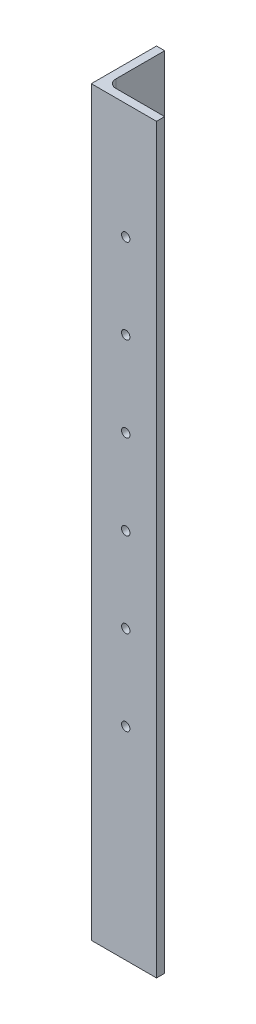
ISO-10303-21;
HEADER;
FILE_DESCRIPTION(('STEP AP214'),'2;1');
FILE_NAME('part.step','',(''),(''),'','','');
FILE_SCHEMA(('AUTOMOTIVE_DESIGN { 1 0 10303 214 1 1 1 1 }'));
ENDSEC;
DATA;
#1=APPLICATION_CONTEXT('core data for automotive mechanical design processes');
#2=APPLICATION_PROTOCOL_DEFINITION('international standard','automotive_design',2000,#1);
#3=PRODUCT_CONTEXT('',#1,'mechanical');
#4=PRODUCT('Part','Part','',(#3));
#5=PRODUCT_RELATED_PRODUCT_CATEGORY('part','',(#4));
#6=PRODUCT_DEFINITION_FORMATION('','',#4);
#7=PRODUCT_DEFINITION_CONTEXT('part definition',#1,'design');
#8=PRODUCT_DEFINITION('design','',#6,#7);
#9=PRODUCT_DEFINITION_SHAPE('','',#8);
#10=(LENGTH_UNIT() NAMED_UNIT(*) SI_UNIT(.MILLI.,.METRE.));
#11=(NAMED_UNIT(*) PLANE_ANGLE_UNIT() SI_UNIT($,.RADIAN.));
#12=(NAMED_UNIT(*) SI_UNIT($,.STERADIAN.) SOLID_ANGLE_UNIT());
#13=UNCERTAINTY_MEASURE_WITH_UNIT(LENGTH_MEASURE(1.E-05),#10,'distance_accuracy_value','');
#14=(GEOMETRIC_REPRESENTATION_CONTEXT(3) GLOBAL_UNCERTAINTY_ASSIGNED_CONTEXT((#13)) GLOBAL_UNIT_ASSIGNED_CONTEXT((#10,
#11,#12)) REPRESENTATION_CONTEXT('',''));
#15=CARTESIAN_POINT('',(0.,0.,0.));
#16=DIRECTION('',(0.,0.,1.));
#17=DIRECTION('',(1.,0.,0.));
#18=AXIS2_PLACEMENT_3D('',#15,#16,#17);
#19=CARTESIAN_POINT('',(-304.799999999993,494.215269696113,431.799999999998));
#20=DIRECTION('',(-1.,0.,0.));
#21=DIRECTION('',(0.,0.,1.));
#22=AXIS2_PLACEMENT_3D('',#19,#20,#21);
#23=CYLINDRICAL_SURFACE('',#22,3.26389999999999);
#24=CARTESIAN_POINT('',(-304.799999999993,494.215269696113,431.799999999998));
#25=DIRECTION('',(-1.,0.,0.));
#26=DIRECTION('',(0.,0.,1.));
#27=AXIS2_PLACEMENT_3D('',#24,#25,#26);
#28=CIRCLE('',#27,3.26389999999999);
#29=CARTESIAN_POINT('',(-304.799999999993,494.215269696113,435.063899999998));
#30=VERTEX_POINT('',#29);
#31=EDGE_CURVE('E49',#30,#30,#28,.T.);
#32=ORIENTED_EDGE('',*,*,#31,.T.);
#33=EDGE_LOOP('',(#32));
#34=FACE_BOUND('',#33,.T.);
#35=CARTESIAN_POINT('',(-298.449999999993,494.215269696113,431.799999999998));
#36=DIRECTION('',(-1.,0.,0.));
#37=DIRECTION('',(0.,0.,1.));
#38=AXIS2_PLACEMENT_3D('',#35,#36,#37);
#39=CIRCLE('',#38,3.26389999999999);
#40=CARTESIAN_POINT('',(-298.449999999993,494.215269696113,435.063899999998));
#41=VERTEX_POINT('',#40);
#42=EDGE_CURVE('E12',#41,#41,#39,.T.);
#43=ORIENTED_EDGE('',*,*,#42,.F.);
#44=EDGE_LOOP('',(#43));
#45=FACE_BOUND('',#44,.T.);
#46=ADVANCED_FACE('F42',(#34,#45),#23,.F.);
#47=CARTESIAN_POINT('',(-304.799999999993,428.175269696113,431.799999999998));
#48=DIRECTION('',(-1.,0.,0.));
#49=DIRECTION('',(0.,0.,1.));
#50=AXIS2_PLACEMENT_3D('',#47,#48,#49);
#51=CYLINDRICAL_SURFACE('',#50,3.26389999999999);
#52=CARTESIAN_POINT('',(-304.799999999993,428.175269696113,431.799999999998));
#53=DIRECTION('',(-1.,0.,0.));
#54=DIRECTION('',(0.,0.,1.));
#55=AXIS2_PLACEMENT_3D('',#52,#53,#54);
#56=CIRCLE('',#55,3.26389999999999);
#57=CARTESIAN_POINT('',(-304.799999999993,428.175269696113,435.063899999998));
#58=VERTEX_POINT('',#57);
#59=EDGE_CURVE('E176',#58,#58,#56,.T.);
#60=ORIENTED_EDGE('',*,*,#59,.T.);
#61=EDGE_LOOP('',(#60));
#62=FACE_BOUND('',#61,.T.);
#63=CARTESIAN_POINT('',(-298.449999999993,428.175269696113,431.799999999998));
#64=DIRECTION('',(-1.,0.,0.));
#65=DIRECTION('',(0.,0.,1.));
#66=AXIS2_PLACEMENT_3D('',#63,#64,#65);
#67=CIRCLE('',#66,3.26389999999999);
#68=CARTESIAN_POINT('',(-298.449999999993,428.175269696113,435.063899999998));
#69=VERTEX_POINT('',#68);
#70=EDGE_CURVE('E179',#69,#69,#67,.T.);
#71=ORIENTED_EDGE('',*,*,#70,.F.);
#72=EDGE_LOOP('',(#71));
#73=FACE_BOUND('',#72,.T.);
#74=ADVANCED_FACE('F204',(#62,#73),#51,.F.);
#75=CARTESIAN_POINT('',(-304.799999999993,362.135269696113,431.799999999998));
#76=DIRECTION('',(-1.,0.,0.));
#77=DIRECTION('',(0.,0.,1.));
#78=AXIS2_PLACEMENT_3D('',#75,#76,#77);
#79=CYLINDRICAL_SURFACE('',#78,3.26389999999999);
#80=CARTESIAN_POINT('',(-304.799999999993,362.135269696113,431.799999999998));
#81=DIRECTION('',(-1.,0.,0.));
#82=DIRECTION('',(0.,0.,1.));
#83=AXIS2_PLACEMENT_3D('',#80,#81,#82);
#84=CIRCLE('',#83,3.26389999999999);
#85=CARTESIAN_POINT('',(-304.799999999993,362.135269696113,435.063899999998));
#86=VERTEX_POINT('',#85);
#87=EDGE_CURVE('E170',#86,#86,#84,.T.);
#88=ORIENTED_EDGE('',*,*,#87,.T.);
#89=EDGE_LOOP('',(#88));
#90=FACE_BOUND('',#89,.T.);
#91=CARTESIAN_POINT('',(-298.449999999993,362.135269696113,431.799999999998));
#92=DIRECTION('',(-1.,0.,0.));
#93=DIRECTION('',(0.,0.,1.));
#94=AXIS2_PLACEMENT_3D('',#91,#92,#93);
#95=CIRCLE('',#94,3.26389999999999);
#96=CARTESIAN_POINT('',(-298.449999999993,362.135269696113,435.063899999998));
#97=VERTEX_POINT('',#96);
#98=EDGE_CURVE('E173',#97,#97,#95,.T.);
#99=ORIENTED_EDGE('',*,*,#98,.F.);
#100=EDGE_LOOP('',(#99));
#101=FACE_BOUND('',#100,.T.);
#102=ADVANCED_FACE('F209',(#90,#101),#79,.F.);
#103=CARTESIAN_POINT('',(-304.799999999993,296.095269696113,431.799999999998));
#104=DIRECTION('',(-1.,0.,0.));
#105=DIRECTION('',(0.,0.,1.));
#106=AXIS2_PLACEMENT_3D('',#103,#104,#105);
#107=CYLINDRICAL_SURFACE('',#106,3.26389999999999);
#108=CARTESIAN_POINT('',(-304.799999999993,296.095269696113,431.799999999998));
#109=DIRECTION('',(-1.,0.,0.));
#110=DIRECTION('',(0.,0.,1.));
#111=AXIS2_PLACEMENT_3D('',#108,#109,#110);
#112=CIRCLE('',#111,3.26389999999999);
#113=CARTESIAN_POINT('',(-304.799999999993,296.095269696113,435.063899999998));
#114=VERTEX_POINT('',#113);
#115=EDGE_CURVE('E152',#114,#114,#112,.T.);
#116=ORIENTED_EDGE('',*,*,#115,.T.);
#117=EDGE_LOOP('',(#116));
#118=FACE_BOUND('',#117,.T.);
#119=CARTESIAN_POINT('',(-298.449999999993,296.095269696113,431.799999999998));
#120=DIRECTION('',(-1.,0.,0.));
#121=DIRECTION('',(0.,0.,1.));
#122=AXIS2_PLACEMENT_3D('',#119,#120,#121);
#123=CIRCLE('',#122,3.26389999999999);
#124=CARTESIAN_POINT('',(-298.449999999993,296.095269696113,435.063899999998));
#125=VERTEX_POINT('',#124);
#126=EDGE_CURVE('E167',#125,#125,#123,.T.);
#127=ORIENTED_EDGE('',*,*,#126,.F.);
#128=EDGE_LOOP('',(#127));
#129=FACE_BOUND('',#128,.T.);
#130=ADVANCED_FACE('F199',(#118,#129),#107,.F.);
#131=CARTESIAN_POINT('',(-298.449999999993,675.092048968553,406.399999999998));
#132=DIRECTION('',(0.,0.,1.));
#133=DIRECTION('',(1.,0.,0.));
#134=AXIS2_PLACEMENT_3D('',#131,#132,#133);
#135=PLANE('',#134);
#136=DIRECTION('',(-1.,0.,0.));
#137=VECTOR('',#136,1.);
#138=CARTESIAN_POINT('',(-298.449999999993,584.2,406.399999999998));
#139=LINE('',#138,#137);
#140=CARTESIAN_POINT('',(-298.449999999993,584.2,406.399999999998));
#141=VERTEX_POINT('',#140);
#142=CARTESIAN_POINT('',(-304.799999999993,584.2,406.399999999998));
#143=VERTEX_POINT('',#142);
#144=EDGE_CURVE('E113',#141,#143,#139,.T.);
#145=ORIENTED_EDGE('',*,*,#144,.F.);
#146=DIRECTION('',(0.,-1.,0.));
#147=VECTOR('',#146,1.);
#148=CARTESIAN_POINT('',(-298.449999999993,675.092048968553,406.399999999998));
#149=LINE('',#148,#147);
#150=CARTESIAN_POINT('',(-298.449999999993,6.35,406.399999999998));
#151=VERTEX_POINT('',#150);
#152=EDGE_CURVE('E141',#141,#151,#149,.T.);
#153=ORIENTED_EDGE('',*,*,#152,.T.);
#154=DIRECTION('',(-1.,0.,0.));
#155=VECTOR('',#154,1.);
#156=CARTESIAN_POINT('',(-298.449999999993,6.35,406.399999999998));
#157=LINE('',#156,#155);
#158=CARTESIAN_POINT('',(-304.799999999993,6.35,406.399999999998));
#159=VERTEX_POINT('',#158);
#160=EDGE_CURVE('E121',#151,#159,#157,.T.);
#161=ORIENTED_EDGE('',*,*,#160,.T.);
#162=DIRECTION('',(0.,-1.,0.));
#163=VECTOR('',#162,1.);
#164=CARTESIAN_POINT('',(-304.799999999993,675.092048968553,406.399999999998));
#165=LINE('',#164,#163);
#166=EDGE_CURVE('E106',#143,#159,#165,.T.);
#167=ORIENTED_EDGE('',*,*,#166,.F.);
#168=EDGE_LOOP('',(#145,#153,#161,#167));
#169=FACE_BOUND('',#168,.T.);
#170=ADVANCED_FACE('F118',(#169),#135,.F.);
#171=CARTESIAN_POINT('',(-304.799999999993,675.092048968553,406.399999999998));
#172=DIRECTION('',(1.,0.,0.));
#173=DIRECTION('',(0.,0.,-1.));
#174=AXIS2_PLACEMENT_3D('',#171,#172,#173);
#175=PLANE('',#174);
#176=CARTESIAN_POINT('',(-304.799999999993,230.055269696113,431.799999999998));
#177=DIRECTION('',(-1.,0.,0.));
#178=DIRECTION('',(0.,0.,1.));
#179=AXIS2_PLACEMENT_3D('',#176,#177,#178);
#180=CIRCLE('',#179,3.26389999999999);
#181=CARTESIAN_POINT('',(-304.799999999993,230.055269696113,435.063899999998));
#182=VERTEX_POINT('',#181);
#183=EDGE_CURVE('E297',#182,#182,#180,.T.);
#184=ORIENTED_EDGE('',*,*,#183,.F.);
#185=EDGE_LOOP('',(#184));
#186=FACE_BOUND('',#185,.T.);
#187=CARTESIAN_POINT('',(-304.799999999993,164.015269696113,431.799999999998));
#188=DIRECTION('',(-1.,0.,0.));
#189=DIRECTION('',(0.,0.,1.));
#190=AXIS2_PLACEMENT_3D('',#187,#188,#189);
#191=CIRCLE('',#190,3.26389999999999);
#192=CARTESIAN_POINT('',(-304.799999999993,164.015269696113,435.063899999998));
#193=VERTEX_POINT('',#192);
#194=EDGE_CURVE('E291',#193,#193,#191,.T.);
#195=ORIENTED_EDGE('',*,*,#194,.F.);
#196=EDGE_LOOP('',(#195));
#197=FACE_BOUND('',#196,.T.);
#198=DIRECTION('',(0.,0.,1.));
#199=VECTOR('',#198,1.);
#200=CARTESIAN_POINT('',(-304.799999999993,584.2,406.399999999998));
#201=LINE('',#200,#199);
#202=CARTESIAN_POINT('',(-304.799999999993,584.2,457.199999999998));
#203=VERTEX_POINT('',#202);
#204=EDGE_CURVE('E101',#143,#203,#201,.T.);
#205=ORIENTED_EDGE('',*,*,#204,.F.);
#206=ORIENTED_EDGE('',*,*,#166,.T.);
#207=DIRECTION('',(0.,0.,1.));
#208=VECTOR('',#207,1.);
#209=CARTESIAN_POINT('',(-304.799999999993,6.35,406.399999999998));
#210=LINE('',#209,#208);
#211=CARTESIAN_POINT('',(-304.799999999993,6.35,457.199999999998));
#212=VERTEX_POINT('',#211);
#213=EDGE_CURVE('E122',#159,#212,#210,.T.);
#214=ORIENTED_EDGE('',*,*,#213,.T.);
#215=DIRECTION('',(0.,-1.,0.));
#216=VECTOR('',#215,1.);
#217=CARTESIAN_POINT('',(-304.799999999993,675.092048968553,457.199999999998));
#218=LINE('',#217,#216);
#219=EDGE_CURVE('E108',#203,#212,#218,.T.);
#220=ORIENTED_EDGE('',*,*,#219,.F.);
#221=EDGE_LOOP('',(#205,#206,#214,#220));
#222=FACE_BOUND('',#221,.T.);
#223=ORIENTED_EDGE('',*,*,#115,.F.);
#224=EDGE_LOOP('',(#223));
#225=FACE_BOUND('',#224,.T.);
#226=ORIENTED_EDGE('',*,*,#87,.F.);
#227=EDGE_LOOP('',(#226));
#228=FACE_BOUND('',#227,.T.);
#229=ORIENTED_EDGE('',*,*,#59,.F.);
#230=EDGE_LOOP('',(#229));
#231=FACE_BOUND('',#230,.T.);
#232=ORIENTED_EDGE('',*,*,#31,.F.);
#233=EDGE_LOOP('',(#232));
#234=FACE_BOUND('',#233,.T.);
#235=ADVANCED_FACE('F103',(#186,#197,#222,#225,#228,#231,#234),#175,.F.);
#236=CARTESIAN_POINT('',(-304.799999999993,675.092048968553,457.199999999998));
#237=DIRECTION('',(0.,0.,-1.));
#238=DIRECTION('',(-1.,0.,0.));
#239=AXIS2_PLACEMENT_3D('',#236,#237,#238);
#240=PLANE('',#239);
#241=CARTESIAN_POINT('',(-277.98250440743,494.215269696113,457.199999999998));
#242=DIRECTION('',(0.,0.,1.));
#243=DIRECTION('',(1.,0.,0.));
#244=AXIS2_PLACEMENT_3D('',#241,#242,#243);
#245=CIRCLE('',#244,3.26389999999999);
#246=CARTESIAN_POINT('',(-274.71860440743,494.215269696113,457.199999999998));
#247=VERTEX_POINT('',#246);
#248=EDGE_CURVE('E285',#247,#247,#245,.T.);
#249=ORIENTED_EDGE('',*,*,#248,.F.);
#250=EDGE_LOOP('',(#249));
#251=FACE_BOUND('',#250,.T.);
#252=CARTESIAN_POINT('',(-277.98250440743,428.175269696113,457.199999999998));
#253=DIRECTION('',(0.,0.,1.));
#254=DIRECTION('',(1.,0.,0.));
#255=AXIS2_PLACEMENT_3D('',#252,#253,#254);
#256=CIRCLE('',#255,3.26389999999999);
#257=CARTESIAN_POINT('',(-274.71860440743,428.175269696113,457.199999999998));
#258=VERTEX_POINT('',#257);
#259=EDGE_CURVE('E279',#258,#258,#256,.T.);
#260=ORIENTED_EDGE('',*,*,#259,.F.);
#261=EDGE_LOOP('',(#260));
#262=FACE_BOUND('',#261,.T.);
#263=CARTESIAN_POINT('',(-277.98250440743,362.135269696113,457.199999999998));
#264=DIRECTION('',(0.,0.,1.));
#265=DIRECTION('',(1.,0.,0.));
#266=AXIS2_PLACEMENT_3D('',#263,#264,#265);
#267=CIRCLE('',#266,3.26389999999999);
#268=CARTESIAN_POINT('',(-274.71860440743,362.135269696113,457.199999999998));
#269=VERTEX_POINT('',#268);
#270=EDGE_CURVE('E164',#269,#269,#267,.T.);
#271=ORIENTED_EDGE('',*,*,#270,.F.);
#272=EDGE_LOOP('',(#271));
#273=FACE_BOUND('',#272,.T.);
#274=CARTESIAN_POINT('',(-277.98250440743,296.095269696113,457.199999999998));
#275=DIRECTION('',(0.,0.,1.));
#276=DIRECTION('',(1.,0.,0.));
#277=AXIS2_PLACEMENT_3D('',#274,#275,#276);
#278=CIRCLE('',#277,3.26389999999999);
#279=CARTESIAN_POINT('',(-274.71860440743,296.095269696113,457.199999999998));
#280=VERTEX_POINT('',#279);
#281=EDGE_CURVE('E163',#280,#280,#278,.T.);
#282=ORIENTED_EDGE('',*,*,#281,.F.);
#283=EDGE_LOOP('',(#282));
#284=FACE_BOUND('',#283,.T.);
#285=CARTESIAN_POINT('',(-277.98250440743,230.055269696113,457.199999999998));
#286=DIRECTION('',(0.,0.,1.));
#287=DIRECTION('',(1.,0.,0.));
#288=AXIS2_PLACEMENT_3D('',#285,#286,#287);
#289=CIRCLE('',#288,3.26389999999999);
#290=CARTESIAN_POINT('',(-274.71860440743,230.055269696113,457.199999999998));
#291=VERTEX_POINT('',#290);
#292=EDGE_CURVE('E159',#291,#291,#289,.T.);
#293=ORIENTED_EDGE('',*,*,#292,.F.);
#294=EDGE_LOOP('',(#293));
#295=FACE_BOUND('',#294,.T.);
#296=CARTESIAN_POINT('',(-277.98250440743,164.015269696113,457.199999999998));
#297=DIRECTION('',(0.,0.,1.));
#298=DIRECTION('',(1.,0.,0.));
#299=AXIS2_PLACEMENT_3D('',#296,#297,#298);
#300=CIRCLE('',#299,3.26389999999999);
#301=CARTESIAN_POINT('',(-274.71860440743,164.015269696113,457.199999999998));
#302=VERTEX_POINT('',#301);
#303=EDGE_CURVE('E155',#302,#302,#300,.T.);
#304=ORIENTED_EDGE('',*,*,#303,.F.);
#305=EDGE_LOOP('',(#304));
#306=FACE_BOUND('',#305,.T.);
#307=DIRECTION('',(1.,0.,0.));
#308=VECTOR('',#307,1.);
#309=CARTESIAN_POINT('',(-304.799999999993,584.2,457.199999999998));
#310=LINE('',#309,#308);
#311=CARTESIAN_POINT('',(-253.999999999993,584.2,457.199999999998));
#312=VERTEX_POINT('',#311);
#313=EDGE_CURVE('E112',#203,#312,#310,.T.);
#314=ORIENTED_EDGE('',*,*,#313,.F.);
#315=ORIENTED_EDGE('',*,*,#219,.T.);
#316=DIRECTION('',(1.,0.,0.));
#317=VECTOR('',#316,1.);
#318=CARTESIAN_POINT('',(-304.799999999993,6.35,457.199999999998));
#319=LINE('',#318,#317);
#320=CARTESIAN_POINT('',(-253.999999999993,6.35,457.199999999998));
#321=VERTEX_POINT('',#320);
#322=EDGE_CURVE('E134',#212,#321,#319,.T.);
#323=ORIENTED_EDGE('',*,*,#322,.T.);
#324=DIRECTION('',(0.,-1.,0.));
#325=VECTOR('',#324,1.);
#326=CARTESIAN_POINT('',(-253.999999999993,675.092048968553,457.199999999998));
#327=LINE('',#326,#325);
#328=EDGE_CURVE('E135',#312,#321,#327,.T.);
#329=ORIENTED_EDGE('',*,*,#328,.F.);
#330=EDGE_LOOP('',(#314,#315,#323,#329));
#331=FACE_BOUND('',#330,.T.);
#332=ADVANCED_FACE('F187',(#251,#262,#273,#284,#295,#306,#331),#240,.F.);
#333=CARTESIAN_POINT('',(-253.999999999993,675.092048968553,457.199999999998));
#334=DIRECTION('',(-1.,0.,0.));
#335=DIRECTION('',(0.,0.,1.));
#336=AXIS2_PLACEMENT_3D('',#333,#334,#335);
#337=PLANE('',#336);
#338=DIRECTION('',(0.,0.,-1.));
#339=VECTOR('',#338,1.);
#340=CARTESIAN_POINT('',(-253.999999999993,584.2,457.199999999998));
#341=LINE('',#340,#339);
#342=CARTESIAN_POINT('',(-253.999999999993,584.2,450.849999999998));
#343=VERTEX_POINT('',#342);
#344=EDGE_CURVE('E249',#312,#343,#341,.T.);
#345=ORIENTED_EDGE('',*,*,#344,.F.);
#346=ORIENTED_EDGE('',*,*,#328,.T.);
#347=DIRECTION('',(0.,0.,-1.));
#348=VECTOR('',#347,1.);
#349=CARTESIAN_POINT('',(-253.999999999993,6.35,457.199999999998));
#350=LINE('',#349,#348);
#351=CARTESIAN_POINT('',(-253.999999999993,6.35,450.849999999998));
#352=VERTEX_POINT('',#351);
#353=EDGE_CURVE('E137',#321,#352,#350,.T.);
#354=ORIENTED_EDGE('',*,*,#353,.T.);
#355=DIRECTION('',(0.,-1.,0.));
#356=VECTOR('',#355,1.);
#357=CARTESIAN_POINT('',(-253.999999999993,675.092048968553,450.849999999998));
#358=LINE('',#357,#356);
#359=EDGE_CURVE('E138',#343,#352,#358,.T.);
#360=ORIENTED_EDGE('',*,*,#359,.F.);
#361=EDGE_LOOP('',(#345,#346,#354,#360));
#362=FACE_BOUND('',#361,.T.);
#363=ADVANCED_FACE('F195',(#362),#337,.F.);
#364=CARTESIAN_POINT('',(-253.999999999993,675.092048968553,450.849999999998));
#365=DIRECTION('',(0.,0.,1.));
#366=DIRECTION('',(1.,0.,0.));
#367=AXIS2_PLACEMENT_3D('',#364,#365,#366);
#368=PLANE('',#367);
#369=CARTESIAN_POINT('',(-277.98250440743,494.215269696113,450.849999999998));
#370=DIRECTION('',(0.,0.,1.));
#371=DIRECTION('',(1.,0.,0.));
#372=AXIS2_PLACEMENT_3D('',#369,#370,#371);
#373=CIRCLE('',#372,3.26389999999999);
#374=CARTESIAN_POINT('',(-274.71860440743,494.215269696113,450.849999999998));
#375=VERTEX_POINT('',#374);
#376=EDGE_CURVE('E282',#375,#375,#373,.T.);
#377=ORIENTED_EDGE('',*,*,#376,.T.);
#378=EDGE_LOOP('',(#377));
#379=FACE_BOUND('',#378,.T.);
#380=CARTESIAN_POINT('',(-277.98250440743,428.175269696113,450.849999999998));
#381=DIRECTION('',(0.,0.,1.));
#382=DIRECTION('',(1.,0.,0.));
#383=AXIS2_PLACEMENT_3D('',#380,#381,#382);
#384=CIRCLE('',#383,3.26389999999999);
#385=CARTESIAN_POINT('',(-274.71860440743,428.175269696113,450.849999999998));
#386=VERTEX_POINT('',#385);
#387=EDGE_CURVE('E276',#386,#386,#384,.T.);
#388=ORIENTED_EDGE('',*,*,#387,.T.);
#389=EDGE_LOOP('',(#388));
#390=FACE_BOUND('',#389,.T.);
#391=CARTESIAN_POINT('',(-277.98250440743,362.135269696113,450.849999999998));
#392=DIRECTION('',(0.,0.,1.));
#393=DIRECTION('',(1.,0.,0.));
#394=AXIS2_PLACEMENT_3D('',#391,#392,#393);
#395=CIRCLE('',#394,3.26389999999999);
#396=CARTESIAN_POINT('',(-274.71860440743,362.135269696113,450.849999999998));
#397=VERTEX_POINT('',#396);
#398=EDGE_CURVE('E160',#397,#397,#395,.T.);
#399=ORIENTED_EDGE('',*,*,#398,.T.);
#400=EDGE_LOOP('',(#399));
#401=FACE_BOUND('',#400,.T.);
#402=CARTESIAN_POINT('',(-277.98250440743,296.095269696113,450.849999999998));
#403=DIRECTION('',(0.,0.,1.));
#404=DIRECTION('',(1.,0.,0.));
#405=AXIS2_PLACEMENT_3D('',#402,#403,#404);
#406=CIRCLE('',#405,3.26389999999999);
#407=CARTESIAN_POINT('',(-274.71860440743,296.095269696113,450.849999999998));
#408=VERTEX_POINT('',#407);
#409=EDGE_CURVE('E269',#408,#408,#406,.T.);
#410=ORIENTED_EDGE('',*,*,#409,.T.);
#411=EDGE_LOOP('',(#410));
#412=FACE_BOUND('',#411,.T.);
#413=CARTESIAN_POINT('',(-277.98250440743,230.055269696113,450.849999999998));
#414=DIRECTION('',(0.,0.,1.));
#415=DIRECTION('',(1.,0.,0.));
#416=AXIS2_PLACEMENT_3D('',#413,#414,#415);
#417=CIRCLE('',#416,3.26389999999999);
#418=CARTESIAN_POINT('',(-274.71860440743,230.055269696113,450.849999999998));
#419=VERTEX_POINT('',#418);
#420=EDGE_CURVE('E156',#419,#419,#417,.T.);
#421=ORIENTED_EDGE('',*,*,#420,.T.);
#422=EDGE_LOOP('',(#421));
#423=FACE_BOUND('',#422,.T.);
#424=CARTESIAN_POINT('',(-277.98250440743,164.015269696113,450.849999999998));
#425=DIRECTION('',(0.,0.,1.));
#426=DIRECTION('',(1.,0.,0.));
#427=AXIS2_PLACEMENT_3D('',#424,#425,#426);
#428=CIRCLE('',#427,3.26389999999999);
#429=CARTESIAN_POINT('',(-274.71860440743,164.015269696113,450.849999999998));
#430=VERTEX_POINT('',#429);
#431=EDGE_CURVE('E143',#430,#430,#428,.T.);
#432=ORIENTED_EDGE('',*,*,#431,.T.);
#433=EDGE_LOOP('',(#432));
#434=FACE_BOUND('',#433,.T.);
#435=DIRECTION('',(-1.,0.,0.));
#436=VECTOR('',#435,1.);
#437=CARTESIAN_POINT('',(-253.999999999993,6.35,450.849999999998));
#438=LINE('',#437,#436);
#439=CARTESIAN_POINT('',(-292.099999999993,6.35,450.849999999998));
#440=VERTEX_POINT('',#439);
#441=EDGE_CURVE('E140',#352,#440,#438,.T.);
#442=ORIENTED_EDGE('',*,*,#441,.T.);
#443=DIRECTION('',(0.,-1.,0.));
#444=VECTOR('',#443,1.);
#445=CARTESIAN_POINT('',(-292.099999999993,584.2,450.849999999998));
#446=LINE('',#445,#444);
#447=CARTESIAN_POINT('',(-292.099999999993,584.2,450.849999999998));
#448=VERTEX_POINT('',#447);
#449=EDGE_CURVE('E63',#440,#448,#446,.F.);
#450=ORIENTED_EDGE('',*,*,#449,.T.);
#451=DIRECTION('',(-1.,0.,0.));
#452=VECTOR('',#451,1.);
#453=CARTESIAN_POINT('',(-253.999999999993,584.2,450.849999999998));
#454=LINE('',#453,#452);
#455=EDGE_CURVE('E147',#343,#448,#454,.T.);
#456=ORIENTED_EDGE('',*,*,#455,.F.);
#457=ORIENTED_EDGE('',*,*,#359,.T.);
#458=EDGE_LOOP('',(#442,#450,#456,#457));
#459=FACE_BOUND('',#458,.T.);
#460=ADVANCED_FACE('F235',(#379,#390,#401,#412,#423,#434,#459),#368,.F.);
#461=CARTESIAN_POINT('',(-298.449999999993,675.092048968553,450.849999999998));
#462=DIRECTION('',(-1.,0.,0.));
#463=DIRECTION('',(0.,0.,1.));
#464=AXIS2_PLACEMENT_3D('',#461,#462,#463);
#465=PLANE('',#464);
#466=CARTESIAN_POINT('',(-298.449999999993,230.055269696113,431.799999999998));
#467=DIRECTION('',(-1.,0.,0.));
#468=DIRECTION('',(0.,0.,1.));
#469=AXIS2_PLACEMENT_3D('',#466,#467,#468);
#470=CIRCLE('',#469,3.26389999999999);
#471=CARTESIAN_POINT('',(-298.449999999993,230.055269696113,435.063899999998));
#472=VERTEX_POINT('',#471);
#473=EDGE_CURVE('E294',#472,#472,#470,.T.);
#474=ORIENTED_EDGE('',*,*,#473,.T.);
#475=EDGE_LOOP('',(#474));
#476=FACE_BOUND('',#475,.T.);
#477=CARTESIAN_POINT('',(-298.449999999993,164.015269696113,431.799999999998));
#478=DIRECTION('',(-1.,0.,0.));
#479=DIRECTION('',(0.,0.,1.));
#480=AXIS2_PLACEMENT_3D('',#477,#478,#479);
#481=CIRCLE('',#480,3.26389999999999);
#482=CARTESIAN_POINT('',(-298.449999999993,164.015269696113,435.063899999998));
#483=VERTEX_POINT('',#482);
#484=EDGE_CURVE('E288',#483,#483,#481,.T.);
#485=ORIENTED_EDGE('',*,*,#484,.T.);
#486=EDGE_LOOP('',(#485));
#487=FACE_BOUND('',#486,.T.);
#488=DIRECTION('',(0.,0.,-1.));
#489=VECTOR('',#488,1.);
#490=CARTESIAN_POINT('',(-298.449999999993,584.2,450.849999999998));
#491=LINE('',#490,#489);
#492=CARTESIAN_POINT('',(-298.449999999993,584.2,444.499999999998));
#493=VERTEX_POINT('',#492);
#494=EDGE_CURVE('E126',#493,#141,#491,.T.);
#495=ORIENTED_EDGE('',*,*,#494,.F.);
#496=DIRECTION('',(0.,-1.,0.));
#497=VECTOR('',#496,1.);
#498=CARTESIAN_POINT('',(-298.449999999993,6.34999999999997,444.499999999998));
#499=LINE('',#498,#497);
#500=CARTESIAN_POINT('',(-298.449999999993,6.35,444.499999999998));
#501=VERTEX_POINT('',#500);
#502=EDGE_CURVE('E144',#493,#501,#499,.T.);
#503=ORIENTED_EDGE('',*,*,#502,.T.);
#504=DIRECTION('',(0.,0.,-1.));
#505=VECTOR('',#504,1.);
#506=CARTESIAN_POINT('',(-298.449999999993,6.35,450.849999999998));
#507=LINE('',#506,#505);
#508=EDGE_CURVE('E129',#501,#151,#507,.T.);
#509=ORIENTED_EDGE('',*,*,#508,.T.);
#510=ORIENTED_EDGE('',*,*,#152,.F.);
#511=EDGE_LOOP('',(#495,#503,#509,#510));
#512=FACE_BOUND('',#511,.T.);
#513=ORIENTED_EDGE('',*,*,#126,.T.);
#514=EDGE_LOOP('',(#513));
#515=FACE_BOUND('',#514,.T.);
#516=ORIENTED_EDGE('',*,*,#98,.T.);
#517=EDGE_LOOP('',(#516));
#518=FACE_BOUND('',#517,.T.);
#519=ORIENTED_EDGE('',*,*,#70,.T.);
#520=EDGE_LOOP('',(#519));
#521=FACE_BOUND('',#520,.T.);
#522=ORIENTED_EDGE('',*,*,#42,.T.);
#523=EDGE_LOOP('',(#522));
#524=FACE_BOUND('',#523,.T.);
#525=ADVANCED_FACE('F230',(#476,#487,#512,#515,#518,#521,#524),#465,.F.);
#526=CARTESIAN_POINT('',(0.,6.35,0.));
#527=DIRECTION('',(0.,1.,0.));
#528=DIRECTION('',(0.,0.,1.));
#529=AXIS2_PLACEMENT_3D('',#526,#527,#528);
#530=PLANE('',#529);
#531=ORIENTED_EDGE('',*,*,#160,.F.);
#532=ORIENTED_EDGE('',*,*,#508,.F.);
#533=CARTESIAN_POINT('',(-292.099999999993,6.34999999999997,444.499999999998));
#534=DIRECTION('',(0.,1.,0.));
#535=DIRECTION('',(0.,0.,1.));
#536=AXIS2_PLACEMENT_3D('',#533,#534,#535);
#537=CIRCLE('',#536,6.35);
#538=EDGE_CURVE('E56',#501,#440,#537,.T.);
#539=ORIENTED_EDGE('',*,*,#538,.T.);
#540=ORIENTED_EDGE('',*,*,#441,.F.);
#541=ORIENTED_EDGE('',*,*,#353,.F.);
#542=ORIENTED_EDGE('',*,*,#322,.F.);
#543=ORIENTED_EDGE('',*,*,#213,.F.);
#544=EDGE_LOOP('',(#531,#532,#539,#540,#541,#542,#543));
#545=FACE_BOUND('',#544,.T.);
#546=ADVANCED_FACE('F226',(#545),#530,.F.);
#547=CARTESIAN_POINT('',(0.,584.2,0.));
#548=DIRECTION('',(0.,1.,0.));
#549=DIRECTION('',(0.,0.,1.));
#550=AXIS2_PLACEMENT_3D('',#547,#548,#549);
#551=PLANE('',#550);
#552=ORIENTED_EDGE('',*,*,#455,.T.);
#553=CARTESIAN_POINT('',(-292.099999999993,584.2,444.499999999998));
#554=DIRECTION('',(0.,1.,0.));
#555=DIRECTION('',(0.,0.,1.));
#556=AXIS2_PLACEMENT_3D('',#553,#554,#555);
#557=CIRCLE('',#556,6.35);
#558=EDGE_CURVE('E150',#448,#493,#557,.F.);
#559=ORIENTED_EDGE('',*,*,#558,.T.);
#560=ORIENTED_EDGE('',*,*,#494,.T.);
#561=ORIENTED_EDGE('',*,*,#144,.T.);
#562=ORIENTED_EDGE('',*,*,#204,.T.);
#563=ORIENTED_EDGE('',*,*,#313,.T.);
#564=ORIENTED_EDGE('',*,*,#344,.T.);
#565=EDGE_LOOP('',(#552,#559,#560,#561,#562,#563,#564));
#566=FACE_BOUND('',#565,.T.);
#567=ADVANCED_FACE('F124',(#566),#551,.T.);
#568=CARTESIAN_POINT('',(-292.099999999993,675.092048968553,444.499999999998));
#569=DIRECTION('',(0.,1.,0.));
#570=DIRECTION('',(0.,0.,1.));
#571=AXIS2_PLACEMENT_3D('',#568,#569,#570);
#572=CYLINDRICAL_SURFACE('',#571,6.35);
#573=ORIENTED_EDGE('',*,*,#558,.F.);
#574=ORIENTED_EDGE('',*,*,#449,.F.);
#575=ORIENTED_EDGE('',*,*,#538,.F.);
#576=ORIENTED_EDGE('',*,*,#502,.F.);
#577=EDGE_LOOP('',(#573,#574,#575,#576));
#578=FACE_BOUND('',#577,.T.);
#579=ADVANCED_FACE('F220',(#578),#572,.F.);
#580=CARTESIAN_POINT('',(-277.98250440743,164.015269696113,457.199999999998));
#581=DIRECTION('',(0.,0.,1.));
#582=DIRECTION('',(1.,0.,0.));
#583=AXIS2_PLACEMENT_3D('',#580,#581,#582);
#584=CYLINDRICAL_SURFACE('',#583,3.26389999999999);
#585=ORIENTED_EDGE('',*,*,#303,.T.);
#586=EDGE_LOOP('',(#585));
#587=FACE_BOUND('',#586,.T.);
#588=ORIENTED_EDGE('',*,*,#431,.F.);
#589=EDGE_LOOP('',(#588));
#590=FACE_BOUND('',#589,.T.);
#591=ADVANCED_FACE('F223',(#587,#590),#584,.F.);
#592=CARTESIAN_POINT('',(-277.98250440743,230.055269696113,457.199999999998));
#593=DIRECTION('',(0.,0.,1.));
#594=DIRECTION('',(1.,0.,0.));
#595=AXIS2_PLACEMENT_3D('',#592,#593,#594);
#596=CYLINDRICAL_SURFACE('',#595,3.26389999999999);
#597=ORIENTED_EDGE('',*,*,#292,.T.);
#598=EDGE_LOOP('',(#597));
#599=FACE_BOUND('',#598,.T.);
#600=ORIENTED_EDGE('',*,*,#420,.F.);
#601=EDGE_LOOP('',(#600));
#602=FACE_BOUND('',#601,.T.);
#603=ADVANCED_FACE('F341',(#599,#602),#596,.F.);
#604=CARTESIAN_POINT('',(-277.98250440743,296.095269696113,457.199999999998));
#605=DIRECTION('',(0.,0.,1.));
#606=DIRECTION('',(1.,0.,0.));
#607=AXIS2_PLACEMENT_3D('',#604,#605,#606);
#608=CYLINDRICAL_SURFACE('',#607,3.26389999999999);
#609=ORIENTED_EDGE('',*,*,#281,.T.);
#610=EDGE_LOOP('',(#609));
#611=FACE_BOUND('',#610,.T.);
#612=ORIENTED_EDGE('',*,*,#409,.F.);
#613=EDGE_LOOP('',(#612));
#614=FACE_BOUND('',#613,.T.);
#615=ADVANCED_FACE('F338',(#611,#614),#608,.F.);
#616=CARTESIAN_POINT('',(-277.98250440743,362.135269696113,457.199999999998));
#617=DIRECTION('',(0.,0.,1.));
#618=DIRECTION('',(1.,0.,0.));
#619=AXIS2_PLACEMENT_3D('',#616,#617,#618);
#620=CYLINDRICAL_SURFACE('',#619,3.26389999999999);
#621=ORIENTED_EDGE('',*,*,#270,.T.);
#622=EDGE_LOOP('',(#621));
#623=FACE_BOUND('',#622,.T.);
#624=ORIENTED_EDGE('',*,*,#398,.F.);
#625=EDGE_LOOP('',(#624));
#626=FACE_BOUND('',#625,.T.);
#627=ADVANCED_FACE('F334',(#623,#626),#620,.F.);
#628=CARTESIAN_POINT('',(-277.98250440743,428.175269696113,457.199999999998));
#629=DIRECTION('',(0.,0.,1.));
#630=DIRECTION('',(1.,0.,0.));
#631=AXIS2_PLACEMENT_3D('',#628,#629,#630);
#632=CYLINDRICAL_SURFACE('',#631,3.26389999999999);
#633=ORIENTED_EDGE('',*,*,#259,.T.);
#634=EDGE_LOOP('',(#633));
#635=FACE_BOUND('',#634,.T.);
#636=ORIENTED_EDGE('',*,*,#387,.F.);
#637=EDGE_LOOP('',(#636));
#638=FACE_BOUND('',#637,.T.);
#639=ADVANCED_FACE('F328',(#635,#638),#632,.F.);
#640=CARTESIAN_POINT('',(-277.98250440743,494.215269696113,457.199999999998));
#641=DIRECTION('',(0.,0.,1.));
#642=DIRECTION('',(1.,0.,0.));
#643=AXIS2_PLACEMENT_3D('',#640,#641,#642);
#644=CYLINDRICAL_SURFACE('',#643,3.26389999999999);
#645=ORIENTED_EDGE('',*,*,#248,.T.);
#646=EDGE_LOOP('',(#645));
#647=FACE_BOUND('',#646,.T.);
#648=ORIENTED_EDGE('',*,*,#376,.F.);
#649=EDGE_LOOP('',(#648));
#650=FACE_BOUND('',#649,.T.);
#651=ADVANCED_FACE('F322',(#647,#650),#644,.F.);
#652=CARTESIAN_POINT('',(-304.799999999993,164.015269696113,431.799999999998));
#653=DIRECTION('',(-1.,0.,0.));
#654=DIRECTION('',(0.,0.,1.));
#655=AXIS2_PLACEMENT_3D('',#652,#653,#654);
#656=CYLINDRICAL_SURFACE('',#655,3.26389999999999);
#657=ORIENTED_EDGE('',*,*,#194,.T.);
#658=EDGE_LOOP('',(#657));
#659=FACE_BOUND('',#658,.T.);
#660=ORIENTED_EDGE('',*,*,#484,.F.);
#661=EDGE_LOOP('',(#660));
#662=FACE_BOUND('',#661,.T.);
#663=ADVANCED_FACE('F303',(#659,#662),#656,.F.);
#664=CARTESIAN_POINT('',(-304.799999999993,230.055269696113,431.799999999998));
#665=DIRECTION('',(-1.,0.,0.));
#666=DIRECTION('',(0.,0.,1.));
#667=AXIS2_PLACEMENT_3D('',#664,#665,#666);
#668=CYLINDRICAL_SURFACE('',#667,3.26389999999999);
#669=ORIENTED_EDGE('',*,*,#183,.T.);
#670=EDGE_LOOP('',(#669));
#671=FACE_BOUND('',#670,.T.);
#672=ORIENTED_EDGE('',*,*,#473,.F.);
#673=EDGE_LOOP('',(#672));
#674=FACE_BOUND('',#673,.T.);
#675=ADVANCED_FACE('F300',(#671,#674),#668,.F.);
#676=CLOSED_SHELL('',(#46,#74,#102,#130,#170,#235,#332,#363,#460,#525,#546,#567,#579,#591,#603,
#615,#627,#639,#651,#663,#675));
#677=MANIFOLD_SOLID_BREP('B2',#676);
#678=ADVANCED_BREP_SHAPE_REPRESENTATION('',(#18,#677),#14);
#679=SHAPE_DEFINITION_REPRESENTATION(#9,#678);
ENDSEC;
END-ISO-10303-21;
